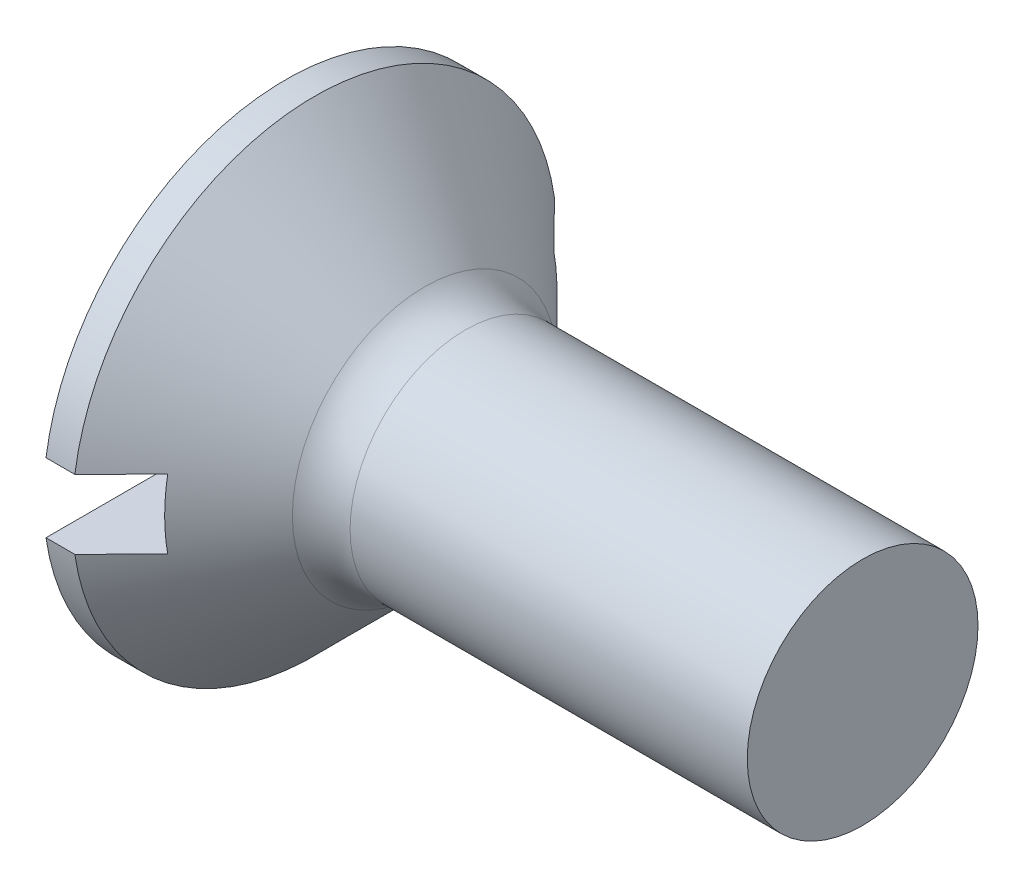
ISO-10303-21;
HEADER;
FILE_DESCRIPTION(('STEP AP214'),'2;1');
FILE_NAME('part.step','',(''),(''),'','','');
FILE_SCHEMA(('AUTOMOTIVE_DESIGN { 1 0 10303 214 1 1 1 1 }'));
ENDSEC;
DATA;
#1=APPLICATION_CONTEXT('core data for automotive mechanical design processes');
#2=APPLICATION_PROTOCOL_DEFINITION('international standard','automotive_design',2000,#1);
#3=PRODUCT_CONTEXT('',#1,'mechanical');
#4=PRODUCT('Part','Part','',(#3));
#5=PRODUCT_RELATED_PRODUCT_CATEGORY('part','',(#4));
#6=PRODUCT_DEFINITION_FORMATION('','',#4);
#7=PRODUCT_DEFINITION_CONTEXT('part definition',#1,'design');
#8=PRODUCT_DEFINITION('design','',#6,#7);
#9=PRODUCT_DEFINITION_SHAPE('','',#8);
#10=(LENGTH_UNIT() NAMED_UNIT(*) SI_UNIT(.MILLI.,.METRE.));
#11=(NAMED_UNIT(*) PLANE_ANGLE_UNIT() SI_UNIT($,.RADIAN.));
#12=(NAMED_UNIT(*) SI_UNIT($,.STERADIAN.) SOLID_ANGLE_UNIT());
#13=UNCERTAINTY_MEASURE_WITH_UNIT(LENGTH_MEASURE(1.E-05),#10,'distance_accuracy_value','');
#14=(GEOMETRIC_REPRESENTATION_CONTEXT(3) GLOBAL_UNCERTAINTY_ASSIGNED_CONTEXT((#13)) GLOBAL_UNIT_ASSIGNED_CONTEXT((#10,
#11,#12)) REPRESENTATION_CONTEXT('',''));
#15=CARTESIAN_POINT('',(0.,0.,0.));
#16=DIRECTION('',(0.,0.,1.));
#17=DIRECTION('',(1.,0.,0.));
#18=AXIS2_PLACEMENT_3D('',#15,#16,#17);
#19=CARTESIAN_POINT('',(0.,0.,0.));
#20=DIRECTION('',(-1.,0.,0.));
#21=DIRECTION('',(0.,0.,1.));
#22=AXIS2_PLACEMENT_3D('',#19,#20,#21);
#23=PLANE('',#22);
#24=DIRECTION('',(0.,0.,-1.));
#25=VECTOR('',#24,1.);
#26=CARTESIAN_POINT('',(0.,0.6,4.2));
#27=LINE('',#26,#25);
#28=CARTESIAN_POINT('',(0.,0.6,4.15692193816531));
#29=VERTEX_POINT('',#28);
#30=CARTESIAN_POINT('',(0.,0.599999999999999,-4.15692193816531));
#31=VERTEX_POINT('',#30);
#32=EDGE_CURVE('E165',#29,#31,#27,.T.);
#33=ORIENTED_EDGE('',*,*,#32,.F.);
#34=CARTESIAN_POINT('',(0.,0.,0.));
#35=DIRECTION('',(-1.,0.,0.));
#36=DIRECTION('',(0.,0.,1.));
#37=AXIS2_PLACEMENT_3D('',#34,#35,#36);
#38=CIRCLE('',#37,4.2);
#39=EDGE_CURVE('E107',#29,#31,#38,.T.);
#40=ORIENTED_EDGE('',*,*,#39,.T.);
#41=EDGE_LOOP('',(#33,#40));
#42=FACE_BOUND('',#41,.T.);
#43=ADVANCED_FACE('F26',(#42),#23,.T.);
#44=CARTESIAN_POINT('',(-6.34999999999999,0.,0.));
#45=DIRECTION('',(-1.,0.,0.));
#46=DIRECTION('',(0.,0.,1.));
#47=AXIS2_PLACEMENT_3D('',#44,#45,#46);
#48=CYLINDRICAL_SURFACE('',#47,4.2);
#49=DIRECTION('',(-1.,0.,0.));
#50=VECTOR('',#49,1.);
#51=CARTESIAN_POINT('',(-6.34999999999999,0.599999999999999,-4.15692193816531));
#52=LINE('',#51,#50);
#53=CARTESIAN_POINT('',(0.500000000000008,0.599999999999999,-4.15692193816531));
#54=VERTEX_POINT('',#53);
#55=EDGE_CURVE('E54',#31,#54,#52,.F.);
#56=ORIENTED_EDGE('',*,*,#55,.F.);
#57=ORIENTED_EDGE('',*,*,#39,.F.);
#58=DIRECTION('',(-1.,0.,0.));
#59=VECTOR('',#58,1.);
#60=CARTESIAN_POINT('',(-6.34999999999999,0.6,4.15692193816531));
#61=LINE('',#60,#59);
#62=CARTESIAN_POINT('',(0.500000000000007,0.6,4.15692193816531));
#63=VERTEX_POINT('',#62);
#64=EDGE_CURVE('E171',#63,#29,#61,.T.);
#65=ORIENTED_EDGE('',*,*,#64,.F.);
#66=CARTESIAN_POINT('',(0.500000000000008,0.,0.));
#67=DIRECTION('',(-1.,0.,0.));
#68=DIRECTION('',(0.,0.,1.));
#69=AXIS2_PLACEMENT_3D('',#66,#67,#68);
#70=CIRCLE('',#69,4.2);
#71=EDGE_CURVE('E101',#63,#54,#70,.T.);
#72=ORIENTED_EDGE('',*,*,#71,.T.);
#73=EDGE_LOOP('',(#56,#57,#65,#72));
#74=FACE_BOUND('',#73,.T.);
#75=ADVANCED_FACE('F150',(#74),#48,.T.);
#76=DIRECTION('',(0.,0.,1.));
#77=VECTOR('',#76,1.);
#78=CARTESIAN_POINT('',(0.,-0.600000000000001,-4.2));
#79=LINE('',#78,#77);
#80=CARTESIAN_POINT('',(0.,-0.600000000000001,-4.15692193816531));
#81=VERTEX_POINT('',#80);
#82=CARTESIAN_POINT('',(0.,-0.600000000000001,4.15692193816531));
#83=VERTEX_POINT('',#82);
#84=EDGE_CURVE('E95',#81,#83,#79,.T.);
#85=ORIENTED_EDGE('',*,*,#84,.F.);
#86=EDGE_CURVE('E103',#81,#83,#38,.T.);
#87=ORIENTED_EDGE('',*,*,#86,.T.);
#88=EDGE_LOOP('',(#85,#87));
#89=FACE_BOUND('',#88,.T.);
#90=ADVANCED_FACE('F28',(#89),#23,.T.);
#91=DIRECTION('',(-1.,0.,0.));
#92=VECTOR('',#91,1.);
#93=CARTESIAN_POINT('',(-6.34999999999999,-0.600000000000001,4.15692193816531));
#94=LINE('',#93,#92);
#95=CARTESIAN_POINT('',(0.500000000000008,-0.600000000000001,4.15692193816531));
#96=VERTEX_POINT('',#95);
#97=EDGE_CURVE('E170',#83,#96,#94,.F.);
#98=ORIENTED_EDGE('',*,*,#97,.F.);
#99=ORIENTED_EDGE('',*,*,#86,.F.);
#100=DIRECTION('',(-1.,0.,0.));
#101=VECTOR('',#100,1.);
#102=CARTESIAN_POINT('',(-6.34999999999999,-0.600000000000001,-4.15692193816531));
#103=LINE('',#102,#101);
#104=CARTESIAN_POINT('',(0.500000000000007,-0.600000000000001,-4.15692193816531));
#105=VERTEX_POINT('',#104);
#106=EDGE_CURVE('E168',#105,#81,#103,.T.);
#107=ORIENTED_EDGE('',*,*,#106,.F.);
#108=EDGE_CURVE('E104',#105,#96,#70,.T.);
#109=ORIENTED_EDGE('',*,*,#108,.T.);
#110=EDGE_LOOP('',(#98,#99,#107,#109));
#111=FACE_BOUND('',#110,.T.);
#112=ADVANCED_FACE('F147',(#111),#48,.T.);
#113=CARTESIAN_POINT('',(0.500000000000008,0.,0.));
#114=DIRECTION('',(-1.,0.,0.));
#115=DIRECTION('',(0.,0.,1.));
#116=AXIS2_PLACEMENT_3D('',#113,#114,#115);
#117=CONICAL_SURFACE('',#116,4.2,0.78539816339745);
#118=CARTESIAN_POINT('',(-4.56300554633495,0.599999999999999,-9.24355298310301));
#119=CARTESIAN_POINT('',(-4.24600723603534,0.599999999999999,-8.9258823515088));
#120=CARTESIAN_POINT('',(-3.92903833767224,0.599999999999999,-8.60818235148398));
#121=CARTESIAN_POINT('',(-3.29519089252672,0.599999999999999,-7.97268003561219));
#122=CARTESIAN_POINT('',(-2.9783123476013,0.599999999999999,-7.65487771791312));
#123=CARTESIAN_POINT('',(-2.34455187800564,0.599999999999999,-7.01900148987753));
#124=CARTESIAN_POINT('',(-2.02767001153055,0.599999999999999,-6.70092752152941));
#125=CARTESIAN_POINT('',(-1.39411705313905,0.599999999999999,-6.06458161569544));
#126=CARTESIAN_POINT('',(-1.07744595737822,0.599999999999999,-5.74630968203735));
#127=CARTESIAN_POINT('',(-0.439782710122304,0.599999999999999,-5.10476781743289));
#128=CARTESIAN_POINT('',(-0.118795367868499,0.599999999999999,-4.78149310334206));
#129=CARTESIAN_POINT('',(0.362237947121703,0.599999999999999,-4.29611852252879));
#130=CARTESIAN_POINT('',(0.522512438448338,0.599999999999999,-4.13424518132527));
#131=CARTESIAN_POINT('',(0.84284185973124,0.599999999999999,-3.81028322215853));
#132=CARTESIAN_POINT('',(1.00289679095939,0.6,-3.64819460545317));
#133=CARTESIAN_POINT('',(1.32264436811793,0.6,-3.32374686654893));
#134=CARTESIAN_POINT('',(1.482337100587,0.6,-3.16138782970926));
#135=CARTESIAN_POINT('',(1.80122734793049,0.6,-2.83617699742846));
#136=CARTESIAN_POINT('',(1.96042485168806,0.6,-2.67332519108526));
#137=CARTESIAN_POINT('',(2.27798310090217,0.6,-2.346837401424));
#138=CARTESIAN_POINT('',(2.43634393039256,0.6,-2.1832015001327));
#139=CARTESIAN_POINT('',(2.67269924336134,0.6,-1.93661567733266));
#140=CARTESIAN_POINT('',(2.75128528365289,0.6,-1.8542332395846));
#141=CARTESIAN_POINT('',(2.90787263193201,0.6,-1.68891500745495));
#142=CARTESIAN_POINT('',(2.98587394762441,0.6,-1.60597922039208));
#143=CARTESIAN_POINT('',(3.10544684138226,0.6,-1.47745401397705));
#144=CARTESIAN_POINT('',(3.14733724784235,0.6,-1.43216144834644));
#145=CARTESIAN_POINT('',(3.23076972006657,0.6,-1.34125476648715));
#146=CARTESIAN_POINT('',(3.27231177917342,0.6,-1.29564064414372));
#147=CARTESIAN_POINT('',(3.35490511324606,0.6,-1.20402456521516));
#148=CARTESIAN_POINT('',(3.39595670135904,0.6,-1.15802289202377));
#149=CARTESIAN_POINT('',(3.47741398126422,0.6,-1.06545539858625));
#150=CARTESIAN_POINT('',(3.51781969732899,0.6,-1.01888959965672));
#151=CARTESIAN_POINT('',(3.61534617885595,0.6,-0.904304101505885));
#152=CARTESIAN_POINT('',(3.67198890051813,0.6,-0.835870311358795));
#153=CARTESIAN_POINT('',(3.75443491954113,0.6,-0.731128116472688));
#154=CARTESIAN_POINT('',(3.78151872315025,0.6,-0.695835241457916));
#155=CARTESIAN_POINT('',(3.83442818781308,0.6,-0.624333469704639));
#156=CARTESIAN_POINT('',(3.86025411081286,0.6,-0.58812476608869));
#157=CARTESIAN_POINT('',(3.91931375630114,0.6,-0.500871666719931));
#158=CARTESIAN_POINT('',(3.95177061612795,0.6,-0.449276850099302));
#159=CARTESIAN_POINT('',(3.99577967360525,0.6,-0.36933669086151));
#160=CARTESIAN_POINT('',(4.00966067743335,0.6,-0.342288140870186));
#161=CARTESIAN_POINT('',(4.03525638339725,0.6,-0.287195591030007));
#162=CARTESIAN_POINT('',(4.04697271406413,0.6,-0.259152358592044));
#163=CARTESIAN_POINT('',(4.06984222692527,0.6,-0.195380760375152));
#164=CARTESIAN_POINT('',(4.08024433174417,0.6,-0.159369843717825));
#165=CARTESIAN_POINT('',(4.09489065039257,0.6,-0.0861793611594763));
#166=CARTESIAN_POINT('',(4.09915715820778,0.6,-0.0490045302917278));
#167=CARTESIAN_POINT('',(4.10061628758592,0.6,0.0256851394983995));
#168=CARTESIAN_POINT('',(4.09777267133953,0.6,0.0632007452673675));
#169=CARTESIAN_POINT('',(4.08560858363435,0.6,0.137201967278454));
#170=CARTESIAN_POINT('',(4.07626994022889,0.6,0.173684394091389));
#171=CARTESIAN_POINT('',(4.05240105619193,0.6,0.246171642438104));
#172=CARTESIAN_POINT('',(4.03770931771714,0.6,0.282120755866795));
#173=CARTESIAN_POINT('',(4.0048507034635,0.6,0.352421052836943));
#174=CARTESIAN_POINT('',(3.98667753444948,0.6,0.386769200401987));
#175=CARTESIAN_POINT('',(3.94786976325244,0.6,0.454391698020889));
#176=CARTESIAN_POINT('',(3.92721638813711,0.6,0.487655075912775));
#177=CARTESIAN_POINT('',(3.88433578239059,0.6,0.553097784406296));
#178=CARTESIAN_POINT('',(3.86210991115064,0.6,0.585278016688101));
#179=CARTESIAN_POINT('',(3.81457382028797,0.6,0.651581987389193));
#180=CARTESIAN_POINT('',(3.7891630851111,0.6,0.685633148831194));
#181=CARTESIAN_POINT('',(3.73740972159131,0.6,0.753022281860292));
#182=CARTESIAN_POINT('',(3.71106696643727,0.6,0.786360155399125));
#183=CARTESIAN_POINT('',(3.63101189507472,0.6,0.885596261553079));
#184=CARTESIAN_POINT('',(3.57629754538184,0.6,0.950683598839948));
#185=CARTESIAN_POINT('',(3.46525380311496,0.6,1.07965626888597));
#186=CARTESIAN_POINT('',(3.40892163508868,0.6,1.14353918079178));
#187=CARTESIAN_POINT('',(3.29530585051175,0.6,1.27041803727517));
#188=CARTESIAN_POINT('',(3.23802251714466,0.6,1.33341423588145));
#189=CARTESIAN_POINT('',(3.12298479001919,0.6,1.45862383839196));
#190=CARTESIAN_POINT('',(3.06523233266877,0.6,1.52083902752064));
#191=CARTESIAN_POINT('',(2.94927074499088,0.6,1.64485037779583));
#192=CARTESIAN_POINT('',(2.89106158145176,0.6,1.70664650784765));
#193=CARTESIAN_POINT('',(2.71607782742413,0.6,1.8914362035954));
#194=CARTESIAN_POINT('',(2.598818175117,0.6,2.01396998991091));
#195=CARTESIAN_POINT('',(2.36411448960322,0.6,2.25774708248495));
#196=CARTESIAN_POINT('',(2.2466739355813,0.6,2.37899374959426));
#197=CARTESIAN_POINT('',(2.011320643903,0.6,2.62102822482681));
#198=CARTESIAN_POINT('',(1.89340790524035,0.6,2.7418160319711));
#199=CARTESIAN_POINT('',(1.53920067574072,0.6,3.10372997116224));
#200=CARTESIAN_POINT('',(1.30244210211622,0.6,3.34440153097691));
#201=CARTESIAN_POINT('',(0.828195724568528,0.6,3.82523070246838));
#202=CARTESIAN_POINT('',(0.590707648083587,0.6,4.06538804483312));
#203=CARTESIAN_POINT('',(0.115359689803603,0.6,4.54532999337503));
#204=CARTESIAN_POINT('',(-0.122500188487128,0.6,4.78511460302332));
#205=CARTESIAN_POINT('',(-0.59843585952858,0.6,5.26442998810647));
#206=CARTESIAN_POINT('',(-0.836511632808671,0.6,5.50396078288317));
#207=CARTESIAN_POINT('',(-1.31282357210653,0.6,5.98286400360529));
#208=CARTESIAN_POINT('',(-1.5510597385177,0.600000000000001,6.2222364291594));
#209=CARTESIAN_POINT('',(-2.26588146323331,0.600000000000001,6.94013600092058));
#210=CARTESIAN_POINT('',(-2.74263267398124,0.600000000000001,7.41849819223157));
#211=CARTESIAN_POINT('',(-3.33143893672127,0.600000000000001,8.00899983049969));
#212=CARTESIAN_POINT('',(-3.44338145682947,0.600000000000001,8.12125154439742));
#213=CARTESIAN_POINT('',(-3.66728071302647,0.600000000000001,8.34574469921585));
#214=CARTESIAN_POINT('',(-3.77923744932912,0.600000000000001,8.4579861399233));
#215=CARTESIAN_POINT('',(-4.0031582180191,0.600000000000001,8.68245495354624));
#216=CARTESIAN_POINT('',(-4.11512225008232,0.600000000000001,8.79468232678505));
#217=CARTESIAN_POINT('',(-4.33905795383685,0.600000000000001,9.019125541103));
#218=CARTESIAN_POINT('',(-4.45102962536065,0.600000000000001,9.13134138234926));
#219=CARTESIAN_POINT('',(-4.56300554633495,0.600000000000001,9.24355298310301));
#220=B_SPLINE_CURVE_WITH_KNOTS('',3,(#118,#119,#120,#121,#122,#123,#124,#125,#126,#127,#128,
#129,#130,#131,#132,#133,#134,#135,#136,#137,#138,#139,#140,#141,#142,#143,#144,#145,#146,#147,
#148,#149,#150,#151,#152,#153,#154,#155,#156,#157,#158,#159,#160,#161,#162,#163,#164,#165,#166,
#167,#168,#169,#170,#171,#172,#173,#174,#175,#176,#177,#178,#179,#180,#181,#182,#183,#184,#185,
#186,#187,#188,#189,#190,#191,#192,#193,#194,#195,#196,#197,#198,#199,#200,#201,#202,#203,#204,
#205,#206,#207,#208,#209,#210,#211,#212,#213,#214,#215,#216,#217,#218,#219),.UNSPECIFIED.,.F.,
.F.,(4,2,2,2,2,2,2,2,2,2,2,2,2,2,2,2,2,2,2,2,2,2,2,2,2,2,2,2,2,2,2,2,2,2,2,2,2,2,2,2,2,2,2,2,2,
2,2,2,2,2,4),(0.,1.34633691031337,2.69269974149251,4.03964677515629,5.3865685278677,
6.75326280996176,7.43664982710674,8.12003286861159,8.8032304306179,9.48644321990409,
10.1695860319826,10.5111450988142,10.8526996570424,11.03778202096,11.2228679139641,
11.4078285352327,11.5927821890647,11.8592146640371,11.9926530436262,12.1260635156147,
12.3086320349772,12.399769493737,12.490838106084,12.6028793993505,12.7145125475576,
12.8267158093192,12.939234265636,13.0554743148281,13.1719265035455,13.2893234418316,
13.4066201044699,13.5340600053015,13.6615173128626,13.91655652205,14.1720630220887,
14.4274947695286,14.6821578166047,14.9368395576516,15.4456347637855,15.9520298164414,
16.4584259488448,17.4712394731476,18.484493856319,19.4977387462517,20.5108998896107,
21.5240635270661,23.5501676869924,24.0257559307744,24.5013524664906,24.9769345830622,
25.4525083962336),.UNSPECIFIED.);
#221=CARTESIAN_POINT('',(1.3,0.6,3.34664010613631));
#222=VERTEX_POINT('',#221);
#223=EDGE_CURVE('E11',#222,#63,#220,.T.);
#224=ORIENTED_EDGE('',*,*,#223,.F.);
#225=CARTESIAN_POINT('',(1.3,0.,0.));
#226=DIRECTION('',(1.,0.,0.));
#227=DIRECTION('',(0.,0.,-1.));
#228=AXIS2_PLACEMENT_3D('',#225,#226,#227);
#229=CIRCLE('',#228,3.40000000000001);
#230=CARTESIAN_POINT('',(1.3,-0.600000000000001,3.34664010613631));
#231=VERTEX_POINT('',#230);
#232=EDGE_CURVE('E83',#231,#222,#229,.F.);
#233=ORIENTED_EDGE('',*,*,#232,.F.);
#234=CARTESIAN_POINT('',(-4.56300554633495,-0.600000000000001,9.24355298310301));
#235=CARTESIAN_POINT('',(-4.24600723603534,-0.600000000000001,8.9258823515088));
#236=CARTESIAN_POINT('',(-3.92903833767224,-0.600000000000001,8.60818235148398));
#237=CARTESIAN_POINT('',(-3.29519089252672,-0.600000000000001,7.97268003561219));
#238=CARTESIAN_POINT('',(-2.9783123476013,-0.600000000000001,7.65487771791312));
#239=CARTESIAN_POINT('',(-2.34455187800564,-0.600000000000001,7.01900148987753));
#240=CARTESIAN_POINT('',(-2.02767001153055,-0.600000000000001,6.70092752152941));
#241=CARTESIAN_POINT('',(-1.39411705313905,-0.600000000000001,6.06458161569545));
#242=CARTESIAN_POINT('',(-1.07744595737822,-0.600000000000001,5.74630968203735));
#243=CARTESIAN_POINT('',(-0.439782710122305,-0.600000000000001,5.10476781743289));
#244=CARTESIAN_POINT('',(-0.118795367868499,-0.600000000000001,4.78149310334207));
#245=CARTESIAN_POINT('',(0.362237947121702,-0.600000000000001,4.29611852252879));
#246=CARTESIAN_POINT('',(0.522512438448338,-0.600000000000001,4.13424518132527));
#247=CARTESIAN_POINT('',(0.842841859731239,-0.600000000000001,3.81028322215853));
#248=CARTESIAN_POINT('',(1.00289679095939,-0.600000000000001,3.64819460545317));
#249=CARTESIAN_POINT('',(1.32264436811793,-0.600000000000001,3.32374686654893));
#250=CARTESIAN_POINT('',(1.482337100587,-0.600000000000001,3.16138782970926));
#251=CARTESIAN_POINT('',(1.80122734793049,-0.600000000000001,2.83617699742846));
#252=CARTESIAN_POINT('',(1.96042485168806,-0.600000000000001,2.67332519108526));
#253=CARTESIAN_POINT('',(2.27798310090218,-0.600000000000001,2.346837401424));
#254=CARTESIAN_POINT('',(2.43634393039256,-0.600000000000001,2.1832015001327));
#255=CARTESIAN_POINT('',(2.67269924336134,-0.600000000000001,1.93661567733266));
#256=CARTESIAN_POINT('',(2.75128528365289,-0.600000000000001,1.85423323958459));
#257=CARTESIAN_POINT('',(2.90787263193201,-0.600000000000001,1.68891500745495));
#258=CARTESIAN_POINT('',(2.98587394762441,-0.600000000000001,1.60597922039208));
#259=CARTESIAN_POINT('',(3.10544684138226,-0.600000000000001,1.47745401397705));
#260=CARTESIAN_POINT('',(3.14733724784235,-0.600000000000001,1.43216144834644));
#261=CARTESIAN_POINT('',(3.23076972006657,-0.600000000000001,1.34125476648714));
#262=CARTESIAN_POINT('',(3.27231177917342,-0.600000000000001,1.29564064414372));
#263=CARTESIAN_POINT('',(3.35490511324606,-0.600000000000001,1.20402456521516));
#264=CARTESIAN_POINT('',(3.39595670135904,-0.600000000000001,1.15802289202377));
#265=CARTESIAN_POINT('',(3.47741398126422,-0.600000000000001,1.06545539858625));
#266=CARTESIAN_POINT('',(3.51781969732899,-0.600000000000001,1.01888959965672));
#267=CARTESIAN_POINT('',(3.61534617885595,-0.600000000000001,0.904304101505885));
#268=CARTESIAN_POINT('',(3.67198890051813,-0.600000000000001,0.835870311358795));
#269=CARTESIAN_POINT('',(3.75443491954113,-0.600000000000001,0.731128116472688));
#270=CARTESIAN_POINT('',(3.78151872315025,-0.600000000000001,0.695835241457915));
#271=CARTESIAN_POINT('',(3.83442818781308,-0.600000000000001,0.624333469704637));
#272=CARTESIAN_POINT('',(3.86025411081286,-0.600000000000001,0.588124766088688));
#273=CARTESIAN_POINT('',(3.91931375630114,-0.600000000000001,0.500871666719929));
#274=CARTESIAN_POINT('',(3.95177061612795,-0.600000000000001,0.4492768500993));
#275=CARTESIAN_POINT('',(3.99577967360525,-0.600000000000001,0.369336690861508));
#276=CARTESIAN_POINT('',(4.00966067743335,-0.600000000000001,0.342288140870185));
#277=CARTESIAN_POINT('',(4.03525638339725,-0.600000000000001,0.287195591030007));
#278=CARTESIAN_POINT('',(4.04697271406413,-0.600000000000001,0.259152358592044));
#279=CARTESIAN_POINT('',(4.06984222692527,-0.600000000000001,0.195380760375151));
#280=CARTESIAN_POINT('',(4.08024433174417,-0.600000000000001,0.159369843717823));
#281=CARTESIAN_POINT('',(4.09489065039257,-0.600000000000001,0.0861793611594746));
#282=CARTESIAN_POINT('',(4.09915715820778,-0.600000000000001,0.0490045302917265));
#283=CARTESIAN_POINT('',(4.10061628758592,-0.600000000000001,-0.0256851394984002));
#284=CARTESIAN_POINT('',(4.09777267133953,-0.600000000000001,-0.0632007452673679));
#285=CARTESIAN_POINT('',(4.08560858363434,-0.600000000000001,-0.137201967278455));
#286=CARTESIAN_POINT('',(4.07626994022889,-0.600000000000001,-0.17368439409139));
#287=CARTESIAN_POINT('',(4.05240105619192,-0.600000000000001,-0.246171642438105));
#288=CARTESIAN_POINT('',(4.03770931771714,-0.600000000000001,-0.282120755866797));
#289=CARTESIAN_POINT('',(4.0048507034635,-0.600000000000001,-0.352421052836945));
#290=CARTESIAN_POINT('',(3.98667753444948,-0.600000000000001,-0.386769200401989));
#291=CARTESIAN_POINT('',(3.94786976325244,-0.600000000000001,-0.454391698020892));
#292=CARTESIAN_POINT('',(3.92721638813711,-0.600000000000001,-0.487655075912777));
#293=CARTESIAN_POINT('',(3.88433578239058,-0.600000000000001,-0.553097784406299));
#294=CARTESIAN_POINT('',(3.86210991115064,-0.600000000000001,-0.585278016688105));
#295=CARTESIAN_POINT('',(3.81457382028797,-0.600000000000001,-0.651581987389197));
#296=CARTESIAN_POINT('',(3.78916308511109,-0.600000000000001,-0.685633148831198));
#297=CARTESIAN_POINT('',(3.7374097215913,-0.600000000000001,-0.753022281860296));
#298=CARTESIAN_POINT('',(3.71106696643726,-0.600000000000001,-0.786360155399129));
#299=CARTESIAN_POINT('',(3.63101189507472,-0.600000000000001,-0.885596261553086));
#300=CARTESIAN_POINT('',(3.57629754538183,-0.600000000000001,-0.950683598839956));
#301=CARTESIAN_POINT('',(3.46525380311495,-0.600000000000001,-1.07965626888597));
#302=CARTESIAN_POINT('',(3.40892163508867,-0.600000000000001,-1.14353918079179));
#303=CARTESIAN_POINT('',(3.29530585051174,-0.600000000000001,-1.27041803727518));
#304=CARTESIAN_POINT('',(3.23802251714465,-0.600000000000001,-1.33341423588146));
#305=CARTESIAN_POINT('',(3.12298479001918,-0.600000000000001,-1.45862383839197));
#306=CARTESIAN_POINT('',(3.06523233266876,-0.600000000000001,-1.52083902752065));
#307=CARTESIAN_POINT('',(2.94927074499087,-0.600000000000001,-1.64485037779585));
#308=CARTESIAN_POINT('',(2.89106158145175,-0.600000000000001,-1.70664650784766));
#309=CARTESIAN_POINT('',(2.71607782742412,-0.600000000000001,-1.89143620359541));
#310=CARTESIAN_POINT('',(2.59881817511698,-0.600000000000001,-2.01396998991093));
#311=CARTESIAN_POINT('',(2.3641144896032,-0.600000000000001,-2.25774708248497));
#312=CARTESIAN_POINT('',(2.24667393558128,-0.600000000000001,-2.37899374959428));
#313=CARTESIAN_POINT('',(2.01132064390298,-0.600000000000001,-2.62102822482683));
#314=CARTESIAN_POINT('',(1.89340790524033,-0.600000000000001,-2.74181603197113));
#315=CARTESIAN_POINT('',(1.5392006757407,-0.600000000000001,-3.10372997116227));
#316=CARTESIAN_POINT('',(1.30244210211619,-0.600000000000001,-3.34440153097694));
#317=CARTESIAN_POINT('',(0.828195724568496,-0.600000000000001,-3.82523070246841));
#318=CARTESIAN_POINT('',(0.590707648083553,-0.600000000000001,-4.06538804483315));
#319=CARTESIAN_POINT('',(0.115359689803565,-0.600000000000001,-4.54532999337507));
#320=CARTESIAN_POINT('',(-0.122500188487168,-0.600000000000001,-4.78511460302336));
#321=CARTESIAN_POINT('',(-0.598435859528625,-0.600000000000001,-5.26442998810652));
#322=CARTESIAN_POINT('',(-0.836511632808717,-0.600000000000001,-5.50396078288322));
#323=CARTESIAN_POINT('',(-1.31282357210659,-0.600000000000001,-5.98286400360534));
#324=CARTESIAN_POINT('',(-1.55105973851776,-0.600000000000001,-6.22223642915946));
#325=CARTESIAN_POINT('',(-2.26588146323337,-0.600000000000002,-6.94013600092064));
#326=CARTESIAN_POINT('',(-2.7426326739813,-0.600000000000001,-7.41849819223163));
#327=CARTESIAN_POINT('',(-3.33143893672133,-0.600000000000001,-8.00899983049975));
#328=CARTESIAN_POINT('',(-3.44338145682952,-0.600000000000001,-8.12125154439748));
#329=CARTESIAN_POINT('',(-3.66728071302652,-0.600000000000001,-8.34574469921589));
#330=CARTESIAN_POINT('',(-3.77923744932916,-0.600000000000001,-8.45798613992334));
#331=CARTESIAN_POINT('',(-4.00315821801912,-0.600000000000001,-8.68245495354627));
#332=CARTESIAN_POINT('',(-4.11512225008234,-0.600000000000001,-8.79468232678508));
#333=CARTESIAN_POINT('',(-4.33905795383686,-0.600000000000001,-9.01912554110301));
#334=CARTESIAN_POINT('',(-4.45102962536065,-0.600000000000001,-9.13134138234927));
#335=CARTESIAN_POINT('',(-4.56300554633495,-0.600000000000001,-9.24355298310301));
#336=B_SPLINE_CURVE_WITH_KNOTS('',3,(#234,#235,#236,#237,#238,#239,#240,#241,#242,#243,#244,
#245,#246,#247,#248,#249,#250,#251,#252,#253,#254,#255,#256,#257,#258,#259,#260,#261,#262,#263,
#264,#265,#266,#267,#268,#269,#270,#271,#272,#273,#274,#275,#276,#277,#278,#279,#280,#281,#282,
#283,#284,#285,#286,#287,#288,#289,#290,#291,#292,#293,#294,#295,#296,#297,#298,#299,#300,#301,
#302,#303,#304,#305,#306,#307,#308,#309,#310,#311,#312,#313,#314,#315,#316,#317,#318,#319,#320,
#321,#322,#323,#324,#325,#326,#327,#328,#329,#330,#331,#332,#333,#334,#335),.UNSPECIFIED.,.F.,
.F.,(4,2,2,2,2,2,2,2,2,2,2,2,2,2,2,2,2,2,2,2,2,2,2,2,2,2,2,2,2,2,2,2,2,2,2,2,2,2,2,2,2,2,2,2,2,
2,2,2,2,2,4),(0.,1.34633691031337,2.6926997414925,4.03964677515628,5.3865685278677,
6.75326280996176,7.43664982710674,8.12003286861159,8.8032304306179,9.48644321990409,
10.1695860319826,10.5111450988142,10.8526996570424,11.03778202096,11.2228679139641,
11.4078285352327,11.5927821890647,11.8592146640371,11.9926530436262,12.1260635156147,
12.3086320349772,12.399769493737,12.490838106084,12.6028793993505,12.7145125475576,
12.8267158093192,12.939234265636,13.0554743148281,13.1719265035455,13.2893234418316,
13.4066201044699,13.5340600053015,13.6615173128626,13.9165565220501,14.1720630220887,
14.4274947695287,14.6821578166047,14.9368395576516,15.4456347637855,15.9520298164414,
16.4584259488448,17.4712394731476,18.4844938563191,19.4977387462518,20.5108998896108,
21.5240635270662,23.5501676869925,24.0257559307745,24.5013524664907,24.9769345830623,
25.4525083962336),.UNSPECIFIED.);
#337=EDGE_CURVE('E40',#96,#231,#336,.T.);
#338=ORIENTED_EDGE('',*,*,#337,.F.);
#339=ORIENTED_EDGE('',*,*,#108,.F.);
#340=CARTESIAN_POINT('',(1.3,-0.600000000000001,-3.34664010613631));
#341=VERTEX_POINT('',#340);
#342=EDGE_CURVE('E119',#341,#105,#336,.T.);
#343=ORIENTED_EDGE('',*,*,#342,.F.);
#344=CARTESIAN_POINT('',(1.3,0.6,-3.34664010613631));
#345=VERTEX_POINT('',#344);
#346=EDGE_CURVE('E91',#345,#341,#229,.F.);
#347=ORIENTED_EDGE('',*,*,#346,.F.);
#348=EDGE_CURVE('E30',#54,#345,#220,.T.);
#349=ORIENTED_EDGE('',*,*,#348,.F.);
#350=ORIENTED_EDGE('',*,*,#71,.F.);
#351=EDGE_LOOP('',(#224,#233,#338,#339,#343,#347,#349,#350));
#352=FACE_BOUND('',#351,.T.);
#353=CARTESIAN_POINT('',(2.40710678118655,0.,0.));
#354=DIRECTION('',(-1.,0.,0.));
#355=DIRECTION('',(0.,0.,1.));
#356=AXIS2_PLACEMENT_3D('',#353,#354,#355);
#357=CIRCLE('',#356,2.29289321881345);
#358=CARTESIAN_POINT('',(2.40710678118655,0.,2.29289321881345));
#359=VERTEX_POINT('',#358);
#360=EDGE_CURVE('E114',#359,#359,#357,.T.);
#361=ORIENTED_EDGE('',*,*,#360,.T.);
#362=EDGE_LOOP('',(#361));
#363=FACE_BOUND('',#362,.T.);
#364=ADVANCED_FACE('F98',(#352,#363),#117,.T.);
#365=CARTESIAN_POINT('',(-6.34999999999999,0.,0.));
#366=DIRECTION('',(-1.,0.,0.));
#367=DIRECTION('',(0.,0.,1.));
#368=AXIS2_PLACEMENT_3D('',#365,#366,#367);
#369=CYLINDRICAL_SURFACE('',#368,2.);
#370=CARTESIAN_POINT('',(3.1142135623731,0.,0.));
#371=DIRECTION('',(-1.,0.,0.));
#372=DIRECTION('',(0.,0.,1.));
#373=AXIS2_PLACEMENT_3D('',#370,#371,#372);
#374=CIRCLE('',#373,2.);
#375=CARTESIAN_POINT('',(3.1142135623731,0.,2.));
#376=VERTEX_POINT('',#375);
#377=EDGE_CURVE('E117',#376,#376,#374,.F.);
#378=ORIENTED_EDGE('',*,*,#377,.T.);
#379=EDGE_LOOP('',(#378));
#380=FACE_BOUND('',#379,.T.);
#381=CARTESIAN_POINT('',(10.,0.,0.));
#382=DIRECTION('',(-1.,0.,0.));
#383=DIRECTION('',(0.,0.,1.));
#384=AXIS2_PLACEMENT_3D('',#381,#382,#383);
#385=CIRCLE('',#384,2.);
#386=CARTESIAN_POINT('',(10.,0.,2.));
#387=VERTEX_POINT('',#386);
#388=EDGE_CURVE('E110',#387,#387,#385,.T.);
#389=ORIENTED_EDGE('',*,*,#388,.T.);
#390=EDGE_LOOP('',(#389));
#391=FACE_BOUND('',#390,.T.);
#392=ADVANCED_FACE('F140',(#380,#391),#369,.T.);
#393=CARTESIAN_POINT('',(10.,2.,0.));
#394=DIRECTION('',(1.,0.,0.));
#395=DIRECTION('',(0.,0.,-1.));
#396=AXIS2_PLACEMENT_3D('',#393,#394,#395);
#397=PLANE('',#396);
#398=ORIENTED_EDGE('',*,*,#388,.F.);
#399=EDGE_LOOP('',(#398));
#400=FACE_BOUND('',#399,.T.);
#401=ADVANCED_FACE('F137',(#400),#397,.T.);
#402=CARTESIAN_POINT('',(3.1142135623731,0.,0.));
#403=DIRECTION('',(-1.,0.,0.));
#404=DIRECTION('',(0.,0.,1.));
#405=AXIS2_PLACEMENT_3D('',#402,#403,#404);
#406=TOROIDAL_SURFACE('',#405,3.,1.);
#407=ORIENTED_EDGE('',*,*,#377,.F.);
#408=EDGE_LOOP('',(#407));
#409=FACE_BOUND('',#408,.T.);
#410=ORIENTED_EDGE('',*,*,#360,.F.);
#411=EDGE_LOOP('',(#410));
#412=FACE_BOUND('',#411,.T.);
#413=ADVANCED_FACE('F134',(#409,#412),#406,.F.);
#414=CARTESIAN_POINT('',(1.3,0.6,4.2));
#415=DIRECTION('',(0.,1.,0.));
#416=DIRECTION('',(0.,0.,1.));
#417=AXIS2_PLACEMENT_3D('',#414,#415,#416);
#418=PLANE('',#417);
#419=ORIENTED_EDGE('',*,*,#55,.T.);
#420=ORIENTED_EDGE('',*,*,#348,.T.);
#421=DIRECTION('',(0.,0.,-1.));
#422=VECTOR('',#421,1.);
#423=CARTESIAN_POINT('',(1.3,0.6,4.2));
#424=LINE('',#423,#422);
#425=EDGE_CURVE('E47',#222,#345,#424,.T.);
#426=ORIENTED_EDGE('',*,*,#425,.F.);
#427=ORIENTED_EDGE('',*,*,#223,.T.);
#428=ORIENTED_EDGE('',*,*,#64,.T.);
#429=ORIENTED_EDGE('',*,*,#32,.T.);
#430=EDGE_LOOP('',(#419,#420,#426,#427,#428,#429));
#431=FACE_BOUND('',#430,.T.);
#432=ADVANCED_FACE('F92',(#431),#418,.F.);
#433=CARTESIAN_POINT('',(1.3,-0.600000000000001,-4.2));
#434=DIRECTION('',(0.,-1.,0.));
#435=DIRECTION('',(0.,0.,-1.));
#436=AXIS2_PLACEMENT_3D('',#433,#434,#435);
#437=PLANE('',#436);
#438=ORIENTED_EDGE('',*,*,#97,.T.);
#439=ORIENTED_EDGE('',*,*,#337,.T.);
#440=DIRECTION('',(0.,0.,1.));
#441=VECTOR('',#440,1.);
#442=CARTESIAN_POINT('',(1.3,-0.600000000000001,-4.2));
#443=LINE('',#442,#441);
#444=EDGE_CURVE('E86',#341,#231,#443,.T.);
#445=ORIENTED_EDGE('',*,*,#444,.F.);
#446=ORIENTED_EDGE('',*,*,#342,.T.);
#447=ORIENTED_EDGE('',*,*,#106,.T.);
#448=ORIENTED_EDGE('',*,*,#84,.T.);
#449=EDGE_LOOP('',(#438,#439,#445,#446,#447,#448));
#450=FACE_BOUND('',#449,.T.);
#451=ADVANCED_FACE('F126',(#450),#437,.F.);
#452=CARTESIAN_POINT('',(1.3,-0.600000000000001,-4.2));
#453=DIRECTION('',(1.,0.,0.));
#454=DIRECTION('',(0.,0.,-1.));
#455=AXIS2_PLACEMENT_3D('',#452,#453,#454);
#456=PLANE('',#455);
#457=ORIENTED_EDGE('',*,*,#232,.T.);
#458=ORIENTED_EDGE('',*,*,#425,.T.);
#459=ORIENTED_EDGE('',*,*,#346,.T.);
#460=ORIENTED_EDGE('',*,*,#444,.T.);
#461=EDGE_LOOP('',(#457,#458,#459,#460));
#462=FACE_BOUND('',#461,.T.);
#463=ADVANCED_FACE('F84',(#462),#456,.F.);
#464=CLOSED_SHELL('',(#43,#75,#90,#112,#364,#392,#401,#413,#432,#451,#463));
#465=MANIFOLD_SOLID_BREP('B2',#464);
#466=ADVANCED_BREP_SHAPE_REPRESENTATION('',(#18,#465),#14);
#467=SHAPE_DEFINITION_REPRESENTATION(#9,#466);
ENDSEC;
END-ISO-10303-21;
